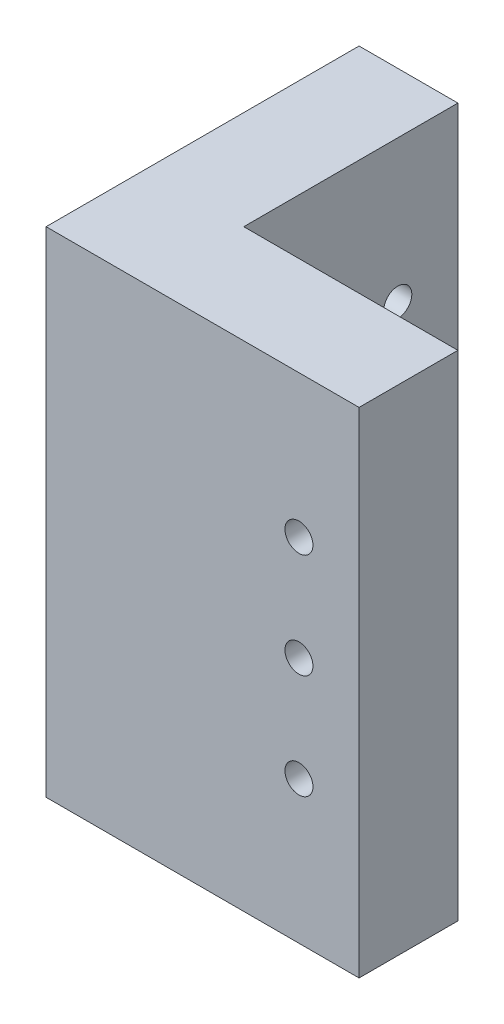
ISO-10303-21;
HEADER;
FILE_DESCRIPTION(('STEP AP214'),'2;1');
FILE_NAME('part.step','',(''),(''),'','','');
FILE_SCHEMA(('AUTOMOTIVE_DESIGN { 1 0 10303 214 1 1 1 1 }'));
ENDSEC;
DATA;
#1=APPLICATION_CONTEXT('core data for automotive mechanical design processes');
#2=APPLICATION_PROTOCOL_DEFINITION('international standard','automotive_design',2000,#1);
#3=PRODUCT_CONTEXT('',#1,'mechanical');
#4=PRODUCT('Part','Part','',(#3));
#5=PRODUCT_RELATED_PRODUCT_CATEGORY('part','',(#4));
#6=PRODUCT_DEFINITION_FORMATION('','',#4);
#7=PRODUCT_DEFINITION_CONTEXT('part definition',#1,'design');
#8=PRODUCT_DEFINITION('design','',#6,#7);
#9=PRODUCT_DEFINITION_SHAPE('','',#8);
#10=(LENGTH_UNIT() NAMED_UNIT(*) SI_UNIT(.MILLI.,.METRE.));
#11=(NAMED_UNIT(*) PLANE_ANGLE_UNIT() SI_UNIT($,.RADIAN.));
#12=(NAMED_UNIT(*) SI_UNIT($,.STERADIAN.) SOLID_ANGLE_UNIT());
#13=UNCERTAINTY_MEASURE_WITH_UNIT(LENGTH_MEASURE(1.E-05),#10,'distance_accuracy_value','');
#14=(GEOMETRIC_REPRESENTATION_CONTEXT(3) GLOBAL_UNCERTAINTY_ASSIGNED_CONTEXT((#13)) GLOBAL_UNIT_ASSIGNED_CONTEXT((#10,
#11,#12)) REPRESENTATION_CONTEXT('',''));
#15=CARTESIAN_POINT('',(0.,0.,0.));
#16=DIRECTION('',(0.,0.,1.));
#17=DIRECTION('',(1.,0.,0.));
#18=AXIS2_PLACEMENT_3D('',#15,#16,#17);
#19=CARTESIAN_POINT('',(-3.,15.,3.));
#20=DIRECTION('',(0.,0.,1.));
#21=DIRECTION('',(1.,0.,0.));
#22=AXIS2_PLACEMENT_3D('',#19,#20,#21);
#23=PLANE('',#22);
#24=CARTESIAN_POINT('',(6.35,6.35,3.));
#25=DIRECTION('',(0.,0.,1.));
#26=DIRECTION('',(1.,0.,0.));
#27=AXIS2_PLACEMENT_3D('',#24,#25,#26);
#28=CIRCLE('',#27,0.85);
#29=CARTESIAN_POINT('',(7.2,6.35,3.));
#30=VERTEX_POINT('',#29);
#31=EDGE_CURVE('E146',#30,#30,#28,.T.);
#32=ORIENTED_EDGE('',*,*,#31,.T.);
#33=EDGE_LOOP('',(#32));
#34=FACE_BOUND('',#33,.T.);
#35=CARTESIAN_POINT('',(6.35,0.,3.));
#36=DIRECTION('',(0.,0.,1.));
#37=DIRECTION('',(1.,0.,0.));
#38=AXIS2_PLACEMENT_3D('',#35,#36,#37);
#39=CIRCLE('',#38,0.85);
#40=CARTESIAN_POINT('',(7.2,0.,3.));
#41=VERTEX_POINT('',#40);
#42=EDGE_CURVE('E200',#41,#41,#39,.T.);
#43=ORIENTED_EDGE('',*,*,#42,.T.);
#44=EDGE_LOOP('',(#43));
#45=FACE_BOUND('',#44,.T.);
#46=CARTESIAN_POINT('',(6.35,-6.35,3.));
#47=DIRECTION('',(0.,0.,1.));
#48=DIRECTION('',(1.,0.,0.));
#49=AXIS2_PLACEMENT_3D('',#46,#47,#48);
#50=CIRCLE('',#49,0.85);
#51=CARTESIAN_POINT('',(7.2,-6.35,3.));
#52=VERTEX_POINT('',#51);
#53=EDGE_CURVE('E203',#52,#52,#50,.T.);
#54=ORIENTED_EDGE('',*,*,#53,.T.);
#55=EDGE_LOOP('',(#54));
#56=FACE_BOUND('',#55,.T.);
#57=DIRECTION('',(-1.,0.,0.));
#58=VECTOR('',#57,1.);
#59=CARTESIAN_POINT('',(-3.,-15.,3.));
#60=LINE('',#59,#58);
#61=CARTESIAN_POINT('',(10.,-15.,3.00000000000001));
#62=VERTEX_POINT('',#61);
#63=CARTESIAN_POINT('',(-3.,-15.,3.));
#64=VERTEX_POINT('',#63);
#65=EDGE_CURVE('E141',#62,#64,#60,.T.);
#66=ORIENTED_EDGE('',*,*,#65,.T.);
#67=DIRECTION('',(0.,-1.,0.));
#68=VECTOR('',#67,1.);
#69=CARTESIAN_POINT('',(-3.,15.,3.));
#70=LINE('',#69,#68);
#71=CARTESIAN_POINT('',(-3.,15.,3.));
#72=VERTEX_POINT('',#71);
#73=EDGE_CURVE('E11',#72,#64,#70,.T.);
#74=ORIENTED_EDGE('',*,*,#73,.F.);
#75=DIRECTION('',(-1.,0.,0.));
#76=VECTOR('',#75,1.);
#77=CARTESIAN_POINT('',(-3.,15.,3.));
#78=LINE('',#77,#76);
#79=CARTESIAN_POINT('',(10.,15.,3.00000000000001));
#80=VERTEX_POINT('',#79);
#81=EDGE_CURVE('E158',#80,#72,#78,.T.);
#82=ORIENTED_EDGE('',*,*,#81,.F.);
#83=DIRECTION('',(0.,-1.,0.));
#84=VECTOR('',#83,1.);
#85=CARTESIAN_POINT('',(10.,15.,3.00000000000001));
#86=LINE('',#85,#84);
#87=EDGE_CURVE('E137',#80,#62,#86,.T.);
#88=ORIENTED_EDGE('',*,*,#87,.T.);
#89=EDGE_LOOP('',(#66,#74,#82,#88));
#90=FACE_BOUND('',#89,.T.);
#91=ADVANCED_FACE('F39',(#34,#45,#56,#90),#23,.F.);
#92=CARTESIAN_POINT('',(-3.,15.,-10.));
#93=DIRECTION('',(-1.,0.,0.));
#94=DIRECTION('',(0.,0.,1.));
#95=AXIS2_PLACEMENT_3D('',#92,#93,#94);
#96=PLANE('',#95);
#97=CARTESIAN_POINT('',(-3.,6.35,-6.35));
#98=DIRECTION('',(-1.,0.,0.));
#99=DIRECTION('',(0.,0.,1.));
#100=AXIS2_PLACEMENT_3D('',#97,#98,#99);
#101=CIRCLE('',#100,0.85);
#102=CARTESIAN_POINT('',(-3.,6.35,-5.5));
#103=VERTEX_POINT('',#102);
#104=EDGE_CURVE('E230',#103,#103,#101,.F.);
#105=ORIENTED_EDGE('',*,*,#104,.F.);
#106=EDGE_LOOP('',(#105));
#107=FACE_BOUND('',#106,.T.);
#108=CARTESIAN_POINT('',(-3.,0.,-6.35));
#109=DIRECTION('',(-1.,0.,0.));
#110=DIRECTION('',(0.,0.,1.));
#111=AXIS2_PLACEMENT_3D('',#108,#109,#110);
#112=CIRCLE('',#111,0.85);
#113=CARTESIAN_POINT('',(-3.,0.,-5.5));
#114=VERTEX_POINT('',#113);
#115=EDGE_CURVE('E232',#114,#114,#112,.F.);
#116=ORIENTED_EDGE('',*,*,#115,.F.);
#117=EDGE_LOOP('',(#116));
#118=FACE_BOUND('',#117,.T.);
#119=CARTESIAN_POINT('',(-3.,-6.35,-6.35));
#120=DIRECTION('',(-1.,0.,0.));
#121=DIRECTION('',(0.,0.,1.));
#122=AXIS2_PLACEMENT_3D('',#119,#120,#121);
#123=CIRCLE('',#122,0.85);
#124=CARTESIAN_POINT('',(-3.,-6.35,-5.5));
#125=VERTEX_POINT('',#124);
#126=EDGE_CURVE('E227',#125,#125,#123,.F.);
#127=ORIENTED_EDGE('',*,*,#126,.F.);
#128=EDGE_LOOP('',(#127));
#129=FACE_BOUND('',#128,.T.);
#130=DIRECTION('',(0.,0.,-1.));
#131=VECTOR('',#130,1.);
#132=CARTESIAN_POINT('',(-3.,-15.,-10.));
#133=LINE('',#132,#131);
#134=CARTESIAN_POINT('',(-3.,-15.,-10.));
#135=VERTEX_POINT('',#134);
#136=EDGE_CURVE('E145',#64,#135,#133,.T.);
#137=ORIENTED_EDGE('',*,*,#136,.T.);
#138=DIRECTION('',(0.,-1.,0.));
#139=VECTOR('',#138,1.);
#140=CARTESIAN_POINT('',(-3.,15.,-10.));
#141=LINE('',#140,#139);
#142=CARTESIAN_POINT('',(-3.,15.,-10.));
#143=VERTEX_POINT('',#142);
#144=EDGE_CURVE('E48',#143,#135,#141,.T.);
#145=ORIENTED_EDGE('',*,*,#144,.F.);
#146=DIRECTION('',(0.,0.,-1.));
#147=VECTOR('',#146,1.);
#148=CARTESIAN_POINT('',(-3.,15.,-10.));
#149=LINE('',#148,#147);
#150=EDGE_CURVE('E104',#72,#143,#149,.T.);
#151=ORIENTED_EDGE('',*,*,#150,.F.);
#152=ORIENTED_EDGE('',*,*,#73,.T.);
#153=EDGE_LOOP('',(#137,#145,#151,#152));
#154=FACE_BOUND('',#153,.T.);
#155=ADVANCED_FACE('F188',(#107,#118,#129,#154),#96,.F.);
#156=CARTESIAN_POINT('',(-9.,15.,-10.));
#157=DIRECTION('',(0.,0.,1.));
#158=DIRECTION('',(1.,0.,0.));
#159=AXIS2_PLACEMENT_3D('',#156,#157,#158);
#160=PLANE('',#159);
#161=DIRECTION('',(-1.,0.,0.));
#162=VECTOR('',#161,1.);
#163=CARTESIAN_POINT('',(-9.,-15.,-10.));
#164=LINE('',#163,#162);
#165=CARTESIAN_POINT('',(-9.,-15.,-10.));
#166=VERTEX_POINT('',#165);
#167=EDGE_CURVE('E149',#135,#166,#164,.T.);
#168=ORIENTED_EDGE('',*,*,#167,.T.);
#169=DIRECTION('',(0.,-1.,0.));
#170=VECTOR('',#169,1.);
#171=CARTESIAN_POINT('',(-9.,15.,-10.));
#172=LINE('',#171,#170);
#173=CARTESIAN_POINT('',(-9.,15.,-10.));
#174=VERTEX_POINT('',#173);
#175=EDGE_CURVE('E129',#174,#166,#172,.T.);
#176=ORIENTED_EDGE('',*,*,#175,.F.);
#177=DIRECTION('',(-1.,0.,0.));
#178=VECTOR('',#177,1.);
#179=CARTESIAN_POINT('',(-9.,15.,-10.));
#180=LINE('',#179,#178);
#181=EDGE_CURVE('E118',#143,#174,#180,.T.);
#182=ORIENTED_EDGE('',*,*,#181,.F.);
#183=ORIENTED_EDGE('',*,*,#144,.T.);
#184=EDGE_LOOP('',(#168,#176,#182,#183));
#185=FACE_BOUND('',#184,.T.);
#186=ADVANCED_FACE('F169',(#185),#160,.F.);
#187=CARTESIAN_POINT('',(-9.,15.,9.00000000000001));
#188=DIRECTION('',(1.,0.,0.));
#189=DIRECTION('',(0.,0.,-1.));
#190=AXIS2_PLACEMENT_3D('',#187,#188,#189);
#191=PLANE('',#190);
#192=CARTESIAN_POINT('',(-9.,6.35,-6.35));
#193=DIRECTION('',(1.,0.,0.));
#194=DIRECTION('',(0.,0.,-1.));
#195=AXIS2_PLACEMENT_3D('',#192,#193,#194);
#196=CIRCLE('',#195,0.85);
#197=CARTESIAN_POINT('',(-9.,6.35,-7.2));
#198=VERTEX_POINT('',#197);
#199=EDGE_CURVE('E225',#198,#198,#196,.T.);
#200=ORIENTED_EDGE('',*,*,#199,.T.);
#201=EDGE_LOOP('',(#200));
#202=FACE_BOUND('',#201,.T.);
#203=CARTESIAN_POINT('',(-9.,0.,-6.35000000000001));
#204=DIRECTION('',(1.,0.,0.));
#205=DIRECTION('',(0.,0.,-1.));
#206=AXIS2_PLACEMENT_3D('',#203,#204,#205);
#207=CIRCLE('',#206,0.85);
#208=CARTESIAN_POINT('',(-9.,0.,-7.20000000000001));
#209=VERTEX_POINT('',#208);
#210=EDGE_CURVE('E228',#209,#209,#207,.T.);
#211=ORIENTED_EDGE('',*,*,#210,.T.);
#212=EDGE_LOOP('',(#211));
#213=FACE_BOUND('',#212,.T.);
#214=CARTESIAN_POINT('',(-9.,-6.35,-6.35));
#215=DIRECTION('',(1.,0.,0.));
#216=DIRECTION('',(0.,0.,-1.));
#217=AXIS2_PLACEMENT_3D('',#214,#215,#216);
#218=CIRCLE('',#217,0.85);
#219=CARTESIAN_POINT('',(-9.,-6.35,-7.2));
#220=VERTEX_POINT('',#219);
#221=EDGE_CURVE('E288',#220,#220,#218,.T.);
#222=ORIENTED_EDGE('',*,*,#221,.T.);
#223=EDGE_LOOP('',(#222));
#224=FACE_BOUND('',#223,.T.);
#225=DIRECTION('',(0.,0.,1.));
#226=VECTOR('',#225,1.);
#227=CARTESIAN_POINT('',(-9.,-15.,9.00000000000001));
#228=LINE('',#227,#226);
#229=CARTESIAN_POINT('',(-9.,-15.,9.00000000000001));
#230=VERTEX_POINT('',#229);
#231=EDGE_CURVE('E127',#166,#230,#228,.T.);
#232=ORIENTED_EDGE('',*,*,#231,.T.);
#233=DIRECTION('',(0.,-1.,0.));
#234=VECTOR('',#233,1.);
#235=CARTESIAN_POINT('',(-9.,15.,9.00000000000001));
#236=LINE('',#235,#234);
#237=CARTESIAN_POINT('',(-9.,15.,9.00000000000001));
#238=VERTEX_POINT('',#237);
#239=EDGE_CURVE('E124',#238,#230,#236,.T.);
#240=ORIENTED_EDGE('',*,*,#239,.F.);
#241=DIRECTION('',(0.,0.,1.));
#242=VECTOR('',#241,1.);
#243=CARTESIAN_POINT('',(-9.,15.,9.00000000000001));
#244=LINE('',#243,#242);
#245=EDGE_CURVE('E112',#174,#238,#244,.T.);
#246=ORIENTED_EDGE('',*,*,#245,.F.);
#247=ORIENTED_EDGE('',*,*,#175,.T.);
#248=EDGE_LOOP('',(#232,#240,#246,#247));
#249=FACE_BOUND('',#248,.T.);
#250=ADVANCED_FACE('F125',(#202,#213,#224,#249),#191,.F.);
#251=CARTESIAN_POINT('',(10.,15.,9.));
#252=DIRECTION('',(0.,0.,-1.));
#253=DIRECTION('',(-1.,0.,0.));
#254=AXIS2_PLACEMENT_3D('',#251,#252,#253);
#255=PLANE('',#254);
#256=CARTESIAN_POINT('',(6.35,6.35,9.));
#257=DIRECTION('',(0.,0.,1.));
#258=DIRECTION('',(1.,0.,0.));
#259=AXIS2_PLACEMENT_3D('',#256,#257,#258);
#260=CIRCLE('',#259,0.85);
#261=CARTESIAN_POINT('',(7.2,6.35,9.));
#262=VERTEX_POINT('',#261);
#263=EDGE_CURVE('E206',#262,#262,#260,.T.);
#264=ORIENTED_EDGE('',*,*,#263,.F.);
#265=EDGE_LOOP('',(#264));
#266=FACE_BOUND('',#265,.T.);
#267=CARTESIAN_POINT('',(6.35,0.,9.));
#268=DIRECTION('',(0.,0.,1.));
#269=DIRECTION('',(1.,0.,0.));
#270=AXIS2_PLACEMENT_3D('',#267,#268,#269);
#271=CIRCLE('',#270,0.85);
#272=CARTESIAN_POINT('',(7.2,0.,9.));
#273=VERTEX_POINT('',#272);
#274=EDGE_CURVE('E212',#273,#273,#271,.T.);
#275=ORIENTED_EDGE('',*,*,#274,.F.);
#276=EDGE_LOOP('',(#275));
#277=FACE_BOUND('',#276,.T.);
#278=CARTESIAN_POINT('',(6.35,-6.35,9.));
#279=DIRECTION('',(0.,0.,1.));
#280=DIRECTION('',(1.,0.,0.));
#281=AXIS2_PLACEMENT_3D('',#278,#279,#280);
#282=CIRCLE('',#281,0.85);
#283=CARTESIAN_POINT('',(7.2,-6.35,9.));
#284=VERTEX_POINT('',#283);
#285=EDGE_CURVE('E215',#284,#284,#282,.T.);
#286=ORIENTED_EDGE('',*,*,#285,.F.);
#287=EDGE_LOOP('',(#286));
#288=FACE_BOUND('',#287,.T.);
#289=DIRECTION('',(1.,0.,0.));
#290=VECTOR('',#289,1.);
#291=CARTESIAN_POINT('',(10.,-15.,9.));
#292=LINE('',#291,#290);
#293=CARTESIAN_POINT('',(10.,-15.,9.));
#294=VERTEX_POINT('',#293);
#295=EDGE_CURVE('E87',#230,#294,#292,.T.);
#296=ORIENTED_EDGE('',*,*,#295,.T.);
#297=DIRECTION('',(0.,-1.,0.));
#298=VECTOR('',#297,1.);
#299=CARTESIAN_POINT('',(10.,15.,9.));
#300=LINE('',#299,#298);
#301=CARTESIAN_POINT('',(10.,15.,9.));
#302=VERTEX_POINT('',#301);
#303=EDGE_CURVE('E130',#302,#294,#300,.T.);
#304=ORIENTED_EDGE('',*,*,#303,.F.);
#305=DIRECTION('',(1.,0.,0.));
#306=VECTOR('',#305,1.);
#307=CARTESIAN_POINT('',(10.,15.,9.));
#308=LINE('',#307,#306);
#309=EDGE_CURVE('E116',#238,#302,#308,.T.);
#310=ORIENTED_EDGE('',*,*,#309,.F.);
#311=ORIENTED_EDGE('',*,*,#239,.T.);
#312=EDGE_LOOP('',(#296,#304,#310,#311));
#313=FACE_BOUND('',#312,.T.);
#314=ADVANCED_FACE('F132',(#266,#277,#288,#313),#255,.F.);
#315=CARTESIAN_POINT('',(10.,15.,3.00000000000001));
#316=DIRECTION('',(-1.,0.,0.));
#317=DIRECTION('',(0.,0.,1.));
#318=AXIS2_PLACEMENT_3D('',#315,#316,#317);
#319=PLANE('',#318);
#320=DIRECTION('',(0.,0.,-1.));
#321=VECTOR('',#320,1.);
#322=CARTESIAN_POINT('',(10.,-15.,3.00000000000001));
#323=LINE('',#322,#321);
#324=EDGE_CURVE('E94',#294,#62,#323,.T.);
#325=ORIENTED_EDGE('',*,*,#324,.T.);
#326=ORIENTED_EDGE('',*,*,#87,.F.);
#327=DIRECTION('',(0.,0.,-1.));
#328=VECTOR('',#327,1.);
#329=CARTESIAN_POINT('',(10.,15.,3.00000000000001));
#330=LINE('',#329,#328);
#331=EDGE_CURVE('E59',#302,#80,#330,.T.);
#332=ORIENTED_EDGE('',*,*,#331,.F.);
#333=ORIENTED_EDGE('',*,*,#303,.T.);
#334=EDGE_LOOP('',(#325,#326,#332,#333));
#335=FACE_BOUND('',#334,.T.);
#336=ADVANCED_FACE('F176',(#335),#319,.F.);
#337=CARTESIAN_POINT('',(0.,15.,0.));
#338=DIRECTION('',(0.,-1.,0.));
#339=DIRECTION('',(0.,0.,-1.));
#340=AXIS2_PLACEMENT_3D('',#337,#338,#339);
#341=PLANE('',#340);
#342=ORIENTED_EDGE('',*,*,#81,.T.);
#343=ORIENTED_EDGE('',*,*,#150,.T.);
#344=ORIENTED_EDGE('',*,*,#181,.T.);
#345=ORIENTED_EDGE('',*,*,#245,.T.);
#346=ORIENTED_EDGE('',*,*,#309,.T.);
#347=ORIENTED_EDGE('',*,*,#331,.T.);
#348=EDGE_LOOP('',(#342,#343,#344,#345,#346,#347));
#349=FACE_BOUND('',#348,.T.);
#350=ADVANCED_FACE('F114',(#349),#341,.F.);
#351=CARTESIAN_POINT('',(0.,-15.,0.));
#352=DIRECTION('',(0.,-1.,0.));
#353=DIRECTION('',(0.,0.,-1.));
#354=AXIS2_PLACEMENT_3D('',#351,#352,#353);
#355=PLANE('',#354);
#356=ORIENTED_EDGE('',*,*,#65,.F.);
#357=ORIENTED_EDGE('',*,*,#324,.F.);
#358=ORIENTED_EDGE('',*,*,#295,.F.);
#359=ORIENTED_EDGE('',*,*,#231,.F.);
#360=ORIENTED_EDGE('',*,*,#167,.F.);
#361=ORIENTED_EDGE('',*,*,#136,.F.);
#362=EDGE_LOOP('',(#356,#357,#358,#359,#360,#361));
#363=FACE_BOUND('',#362,.T.);
#364=ADVANCED_FACE('F172',(#363),#355,.T.);
#365=CARTESIAN_POINT('',(6.35,-6.35,-10.));
#366=DIRECTION('',(0.,0.,1.));
#367=DIRECTION('',(1.,0.,0.));
#368=AXIS2_PLACEMENT_3D('',#365,#366,#367);
#369=CYLINDRICAL_SURFACE('',#368,0.85);
#370=ORIENTED_EDGE('',*,*,#285,.T.);
#371=EDGE_LOOP('',(#370));
#372=FACE_BOUND('',#371,.T.);
#373=ORIENTED_EDGE('',*,*,#53,.F.);
#374=EDGE_LOOP('',(#373));
#375=FACE_BOUND('',#374,.T.);
#376=ADVANCED_FACE('F252',(#372,#375),#369,.F.);
#377=CARTESIAN_POINT('',(6.35,0.,-10.));
#378=DIRECTION('',(0.,0.,1.));
#379=DIRECTION('',(1.,0.,0.));
#380=AXIS2_PLACEMENT_3D('',#377,#378,#379);
#381=CYLINDRICAL_SURFACE('',#380,0.85);
#382=ORIENTED_EDGE('',*,*,#274,.T.);
#383=EDGE_LOOP('',(#382));
#384=FACE_BOUND('',#383,.T.);
#385=ORIENTED_EDGE('',*,*,#42,.F.);
#386=EDGE_LOOP('',(#385));
#387=FACE_BOUND('',#386,.T.);
#388=ADVANCED_FACE('F246',(#384,#387),#381,.F.);
#389=CARTESIAN_POINT('',(6.35,6.35,-10.));
#390=DIRECTION('',(0.,0.,1.));
#391=DIRECTION('',(1.,0.,0.));
#392=AXIS2_PLACEMENT_3D('',#389,#390,#391);
#393=CYLINDRICAL_SURFACE('',#392,0.85);
#394=ORIENTED_EDGE('',*,*,#263,.T.);
#395=EDGE_LOOP('',(#394));
#396=FACE_BOUND('',#395,.T.);
#397=ORIENTED_EDGE('',*,*,#31,.F.);
#398=EDGE_LOOP('',(#397));
#399=FACE_BOUND('',#398,.T.);
#400=ADVANCED_FACE('F259',(#396,#399),#393,.F.);
#401=CARTESIAN_POINT('',(10.,-6.35,-6.35));
#402=DIRECTION('',(-1.,0.,0.));
#403=DIRECTION('',(0.,0.,1.));
#404=AXIS2_PLACEMENT_3D('',#401,#402,#403);
#405=CYLINDRICAL_SURFACE('',#404,0.85);
#406=ORIENTED_EDGE('',*,*,#221,.F.);
#407=EDGE_LOOP('',(#406));
#408=FACE_BOUND('',#407,.T.);
#409=ORIENTED_EDGE('',*,*,#126,.T.);
#410=EDGE_LOOP('',(#409));
#411=FACE_BOUND('',#410,.T.);
#412=ADVANCED_FACE('F264',(#408,#411),#405,.F.);
#413=CARTESIAN_POINT('',(10.,0.,-6.35));
#414=DIRECTION('',(-1.,0.,0.));
#415=DIRECTION('',(0.,0.,1.));
#416=AXIS2_PLACEMENT_3D('',#413,#414,#415);
#417=CYLINDRICAL_SURFACE('',#416,0.85);
#418=ORIENTED_EDGE('',*,*,#210,.F.);
#419=EDGE_LOOP('',(#418));
#420=FACE_BOUND('',#419,.T.);
#421=ORIENTED_EDGE('',*,*,#115,.T.);
#422=EDGE_LOOP('',(#421));
#423=FACE_BOUND('',#422,.T.);
#424=ADVANCED_FACE('F268',(#420,#423),#417,.F.);
#425=CARTESIAN_POINT('',(10.,6.35,-6.34999999999999));
#426=DIRECTION('',(-1.,0.,0.));
#427=DIRECTION('',(0.,0.,1.));
#428=AXIS2_PLACEMENT_3D('',#425,#426,#427);
#429=CYLINDRICAL_SURFACE('',#428,0.85);
#430=ORIENTED_EDGE('',*,*,#199,.F.);
#431=EDGE_LOOP('',(#430));
#432=FACE_BOUND('',#431,.T.);
#433=ORIENTED_EDGE('',*,*,#104,.T.);
#434=EDGE_LOOP('',(#433));
#435=FACE_BOUND('',#434,.T.);
#436=ADVANCED_FACE('F272',(#432,#435),#429,.F.);
#437=CLOSED_SHELL('',(#91,#155,#186,#250,#314,#336,#350,#364,#376,#388,#400,#412,#424,#436));
#438=MANIFOLD_SOLID_BREP('B2',#437);
#439=ADVANCED_BREP_SHAPE_REPRESENTATION('',(#18,#438),#14);
#440=SHAPE_DEFINITION_REPRESENTATION(#9,#439);
ENDSEC;
END-ISO-10303-21;
